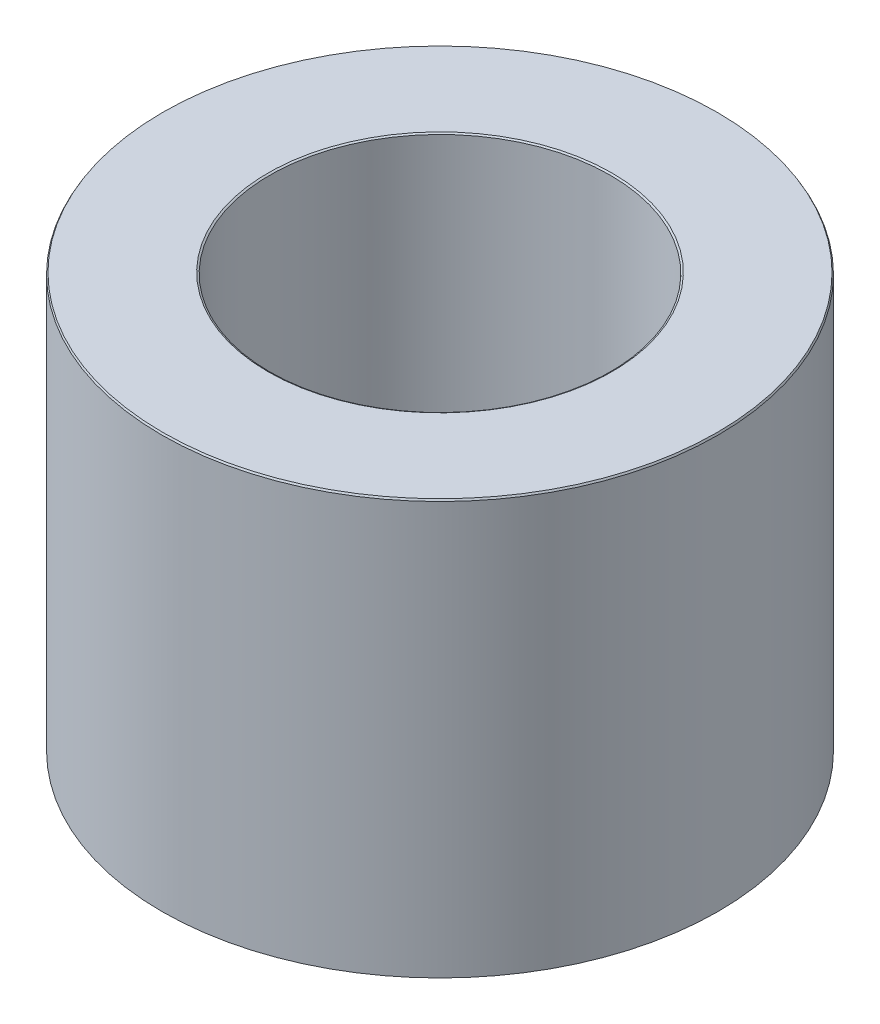
ISO-10303-21;
HEADER;
FILE_DESCRIPTION(('STEP AP214'),'2;1');
FILE_NAME('part.step','',(''),(''),'','','');
FILE_SCHEMA(('AUTOMOTIVE_DESIGN { 1 0 10303 214 1 1 1 1 }'));
ENDSEC;
DATA;
#1=APPLICATION_CONTEXT('core data for automotive mechanical design processes');
#2=APPLICATION_PROTOCOL_DEFINITION('international standard','automotive_design',2000,#1);
#3=PRODUCT_CONTEXT('',#1,'mechanical');
#4=PRODUCT('Part','Part','',(#3));
#5=PRODUCT_RELATED_PRODUCT_CATEGORY('part','',(#4));
#6=PRODUCT_DEFINITION_FORMATION('','',#4);
#7=PRODUCT_DEFINITION_CONTEXT('part definition',#1,'design');
#8=PRODUCT_DEFINITION('design','',#6,#7);
#9=PRODUCT_DEFINITION_SHAPE('','',#8);
#10=(LENGTH_UNIT() NAMED_UNIT(*) SI_UNIT(.MILLI.,.METRE.));
#11=(NAMED_UNIT(*) PLANE_ANGLE_UNIT() SI_UNIT($,.RADIAN.));
#12=(NAMED_UNIT(*) SI_UNIT($,.STERADIAN.) SOLID_ANGLE_UNIT());
#13=UNCERTAINTY_MEASURE_WITH_UNIT(LENGTH_MEASURE(1.E-05),#10,'distance_accuracy_value','');
#14=(GEOMETRIC_REPRESENTATION_CONTEXT(3) GLOBAL_UNCERTAINTY_ASSIGNED_CONTEXT((#13)) GLOBAL_UNIT_ASSIGNED_CONTEXT((#10,
#11,#12)) REPRESENTATION_CONTEXT('',''));
#15=CARTESIAN_POINT('',(0.,0.,0.));
#16=DIRECTION('',(0.,0.,1.));
#17=DIRECTION('',(1.,0.,0.));
#18=AXIS2_PLACEMENT_3D('',#15,#16,#17);
#19=CARTESIAN_POINT('',(0.,48.5175352233138,0.));
#20=DIRECTION('',(0.,-1.,0.));
#21=DIRECTION('',(0.,0.,-1.));
#22=AXIS2_PLACEMENT_3D('',#19,#20,#21);
#23=CYLINDRICAL_SURFACE('',#22,32.5);
#24=CARTESIAN_POINT('',(0.,0.117319997241808,0.));
#25=DIRECTION('',(0.,1.,0.));
#26=DIRECTION('',(0.,0.,1.));
#27=AXIS2_PLACEMENT_3D('',#24,#25,#26);
#28=CIRCLE('',#27,32.5);
#29=CARTESIAN_POINT('',(0.,0.117319997241808,32.5));
#30=VERTEX_POINT('',#29);
#31=EDGE_CURVE('E10',#30,#30,#28,.T.);
#32=ORIENTED_EDGE('',*,*,#31,.T.);
#33=EDGE_LOOP('',(#32));
#34=FACE_BOUND('',#33,.T.);
#35=CARTESIAN_POINT('',(0.,48.3143310273471,0.));
#36=DIRECTION('',(0.,1.,0.));
#37=DIRECTION('',(0.,0.,1.));
#38=AXIS2_PLACEMENT_3D('',#35,#36,#37);
#39=CIRCLE('',#38,32.5);
#40=CARTESIAN_POINT('',(0.,48.3143310273471,32.5));
#41=VERTEX_POINT('',#40);
#42=EDGE_CURVE('E50',#41,#41,#39,.F.);
#43=ORIENTED_EDGE('',*,*,#42,.T.);
#44=EDGE_LOOP('',(#43));
#45=FACE_BOUND('',#44,.T.);
#46=ADVANCED_FACE('F39',(#34,#45),#23,.T.);
#47=CARTESIAN_POINT('',(0.,48.5175352233138,0.));
#48=DIRECTION('',(0.,1.,0.));
#49=DIRECTION('',(0.,0.,1.));
#50=AXIS2_PLACEMENT_3D('',#47,#48,#49);
#51=PLANE('',#50);
#52=CARTESIAN_POINT('',(0.,48.5175352233138,0.));
#53=DIRECTION('',(0.,1.,0.));
#54=DIRECTION('',(0.,0.,1.));
#55=AXIS2_PLACEMENT_3D('',#52,#53,#54);
#56=CIRCLE('',#55,20.0981234863066);
#57=CARTESIAN_POINT('',(0.,48.5175352233138,20.0981234863066));
#58=VERTEX_POINT('',#57);
#59=EDGE_CURVE('E58',#58,#58,#56,.F.);
#60=ORIENTED_EDGE('',*,*,#59,.T.);
#61=EDGE_LOOP('',(#60));
#62=FACE_BOUND('',#61,.T.);
#63=CARTESIAN_POINT('',(0.,48.5175352233138,0.));
#64=DIRECTION('',(0.,1.,0.));
#65=DIRECTION('',(0.,0.,1.));
#66=AXIS2_PLACEMENT_3D('',#63,#64,#65);
#67=CIRCLE('',#66,32.3826800027582);
#68=CARTESIAN_POINT('',(0.,48.5175352233138,32.3826800027582));
#69=VERTEX_POINT('',#68);
#70=EDGE_CURVE('E61',#69,#69,#67,.T.);
#71=ORIENTED_EDGE('',*,*,#70,.T.);
#72=EDGE_LOOP('',(#71));
#73=FACE_BOUND('',#72,.T.);
#74=ADVANCED_FACE('F88',(#62,#73),#51,.T.);
#75=CARTESIAN_POINT('',(0.,0.,0.));
#76=DIRECTION('',(0.,1.,0.));
#77=DIRECTION('',(0.,0.,1.));
#78=AXIS2_PLACEMENT_3D('',#75,#76,#77);
#79=PLANE('',#78);
#80=CARTESIAN_POINT('',(0.,0.,0.));
#81=DIRECTION('',(0.,1.,0.));
#82=DIRECTION('',(0.,0.,1.));
#83=AXIS2_PLACEMENT_3D('',#80,#81,#82);
#84=CIRCLE('',#83,20.0122392875817);
#85=CARTESIAN_POINT('',(0.,0.,-20.0122392875817));
#86=VERTEX_POINT('',#85);
#87=EDGE_CURVE('E51',#86,#86,#84,.T.);
#88=ORIENTED_EDGE('',*,*,#87,.T.);
#89=EDGE_LOOP('',(#88));
#90=FACE_BOUND('',#89,.T.);
#91=CARTESIAN_POINT('',(0.,0.,0.));
#92=DIRECTION('',(0.,1.,0.));
#93=DIRECTION('',(0.,0.,1.));
#94=AXIS2_PLACEMENT_3D('',#91,#92,#93);
#95=CIRCLE('',#94,32.2967958040334);
#96=CARTESIAN_POINT('',(0.,0.,32.2967958040334));
#97=VERTEX_POINT('',#96);
#98=EDGE_CURVE('E54',#97,#97,#95,.F.);
#99=ORIENTED_EDGE('',*,*,#98,.T.);
#100=EDGE_LOOP('',(#99));
#101=FACE_BOUND('',#100,.T.);
#102=ADVANCED_FACE('F83',(#90,#101),#79,.F.);
#103=CARTESIAN_POINT('',(0.,48.5175352233138,0.));
#104=DIRECTION('',(0.,-1.,0.));
#105=DIRECTION('',(0.,0.,-1.));
#106=AXIS2_PLACEMENT_3D('',#103,#104,#105);
#107=CYLINDRICAL_SURFACE('',#106,19.8949192903399);
#108=CARTESIAN_POINT('',(0.,48.4002152260719,0.));
#109=DIRECTION('',(0.,1.,0.));
#110=DIRECTION('',(0.,0.,1.));
#111=AXIS2_PLACEMENT_3D('',#108,#109,#110);
#112=CIRCLE('',#111,19.8949192903399);
#113=CARTESIAN_POINT('',(0.,48.4002152260719,19.8949192903399));
#114=VERTEX_POINT('',#113);
#115=EDGE_CURVE('E67',#114,#114,#112,.T.);
#116=ORIENTED_EDGE('',*,*,#115,.T.);
#117=EDGE_LOOP('',(#116));
#118=FACE_BOUND('',#117,.T.);
#119=CARTESIAN_POINT('',(0.,0.203204195966672,0.));
#120=DIRECTION('',(0.,1.,0.));
#121=DIRECTION('',(0.,0.,1.));
#122=AXIS2_PLACEMENT_3D('',#119,#120,#121);
#123=CIRCLE('',#122,19.8949192903399);
#124=CARTESIAN_POINT('',(0.,0.203204195966672,-19.8949192903399));
#125=VERTEX_POINT('',#124);
#126=EDGE_CURVE('E69',#125,#125,#123,.F.);
#127=ORIENTED_EDGE('',*,*,#126,.T.);
#128=EDGE_LOOP('',(#127));
#129=FACE_BOUND('',#128,.T.);
#130=ADVANCED_FACE('F71',(#118,#129),#107,.F.);
#131=CARTESIAN_POINT('',(0.,48.4002152260719,0.));
#132=DIRECTION('',(0.,1.,0.));
#133=DIRECTION('',(0.,0.,1.));
#134=AXIS2_PLACEMENT_3D('',#131,#132,#133);
#135=CONICAL_SURFACE('',#134,19.8949192903399,1.04719755119662);
#136=ORIENTED_EDGE('',*,*,#59,.F.);
#137=EDGE_LOOP('',(#136));
#138=FACE_BOUND('',#137,.T.);
#139=ORIENTED_EDGE('',*,*,#115,.F.);
#140=EDGE_LOOP('',(#139));
#141=FACE_BOUND('',#140,.T.);
#142=ADVANCED_FACE('F77',(#138,#141),#135,.F.);
#143=CARTESIAN_POINT('',(0.,0.,0.));
#144=DIRECTION('',(0.,-1.,0.));
#145=DIRECTION('',(0.,0.,-1.));
#146=AXIS2_PLACEMENT_3D('',#143,#144,#145);
#147=CONICAL_SURFACE('',#146,20.0122392875817,0.523598775598319);
#148=CARTESIAN_POINT('',(0.,0.203204195966672,-19.8949192903399));
#149=CARTESIAN_POINT('',(0.,0.201087485592019,-19.8961413736445));
#150=CARTESIAN_POINT('',(0.,0.198970775217366,-19.8973634569491));
#151=CARTESIAN_POINT('',(0.,0.194737354468061,-19.8998076235583));
#152=CARTESIAN_POINT('',(0.,0.192620644093408,-19.9010297068629));
#153=CARTESIAN_POINT('',(0.,0.188387223344102,-19.9034738734721));
#154=CARTESIAN_POINT('',(0.,0.186270512969449,-19.9046959567767));
#155=CARTESIAN_POINT('',(0.,0.182037092220143,-19.9071401233859));
#156=CARTESIAN_POINT('',(0.,0.179920381845491,-19.9083622066906));
#157=CARTESIAN_POINT('',(0.,0.175686961096185,-19.9108063732998));
#158=CARTESIAN_POINT('',(0.,0.173570250721532,-19.9120284566044));
#159=CARTESIAN_POINT('',(0.,0.169336829972227,-19.9144726232136));
#160=CARTESIAN_POINT('',(0.,0.167220119597574,-19.9156947065182));
#161=CARTESIAN_POINT('',(0.,0.162986698848268,-19.9181388731274));
#162=CARTESIAN_POINT('',(0.,0.160869988473615,-19.919360956432));
#163=CARTESIAN_POINT('',(0.,0.156636567724309,-19.9218051230412));
#164=CARTESIAN_POINT('',(0.,0.154519857349657,-19.9230272063458));
#165=CARTESIAN_POINT('',(0.,0.150286436600351,-19.925471372955));
#166=CARTESIAN_POINT('',(0.,0.148169726225698,-19.9266934562596));
#167=CARTESIAN_POINT('',(0.,0.143936305476393,-19.9291376228688));
#168=CARTESIAN_POINT('',(0.,0.14181959510174,-19.9303597061734));
#169=CARTESIAN_POINT('',(0.,0.137586174352434,-19.9328038727826));
#170=CARTESIAN_POINT('',(0.,0.135469463977782,-19.9340259560872));
#171=CARTESIAN_POINT('',(0.,0.131236043228476,-19.9364701226964));
#172=CARTESIAN_POINT('',(0.,0.129119332853823,-19.937692206001));
#173=CARTESIAN_POINT('',(0.,0.124885912104517,-19.9401363726102));
#174=CARTESIAN_POINT('',(0.,0.122769201729864,-19.9413584559148));
#175=CARTESIAN_POINT('',(0.,0.118535780980559,-19.943802622524));
#176=CARTESIAN_POINT('',(0.,0.116419070605906,-19.9450247058286));
#177=CARTESIAN_POINT('',(0.,0.1121856498566,-19.9474688724378));
#178=CARTESIAN_POINT('',(0.,0.110068939481948,-19.9486909557424));
#179=CARTESIAN_POINT('',(0.,0.105835518732642,-19.9511351223516));
#180=CARTESIAN_POINT('',(0.,0.103718808357989,-19.9523572056562));
#181=CARTESIAN_POINT('',(0.,0.0994853876086828,-19.9548013722654));
#182=CARTESIAN_POINT('',(0.,0.0973686772340302,-19.95602345557));
#183=CARTESIAN_POINT('',(0.,0.0931352564847247,-19.9584676221792));
#184=CARTESIAN_POINT('',(0.,0.0910185461100718,-19.9596897054839));
#185=CARTESIAN_POINT('',(0.,0.0867851253607661,-19.9621338720931));
#186=CARTESIAN_POINT('',(0.,0.0846684149861132,-19.9633559553977));
#187=CARTESIAN_POINT('',(0.,0.0804349942368077,-19.9658001220069));
#188=CARTESIAN_POINT('',(0.,0.0783182838621551,-19.9670222053115));
#189=CARTESIAN_POINT('',(0.,0.0740848631128493,-19.9694663719207));
#190=CARTESIAN_POINT('',(0.,0.0719681527381961,-19.9706884552253));
#191=CARTESIAN_POINT('',(0.,0.0677347319888903,-19.9731326218345));
#192=CARTESIAN_POINT('',(0.,0.0656180216142377,-19.9743547051391));
#193=CARTESIAN_POINT('',(0.,0.0613846008649322,-19.9767988717483));
#194=CARTESIAN_POINT('',(0.,0.0592678904902794,-19.9780209550529));
#195=CARTESIAN_POINT('',(0.,0.0550344697409736,-19.9804651216621));
#196=CARTESIAN_POINT('',(0.,0.0529177593663207,-19.9816872049667));
#197=CARTESIAN_POINT('',(0.,0.0486843386170152,-19.9841313715759));
#198=CARTESIAN_POINT('',(0.,0.0465676282423626,-19.9853534548805));
#199=CARTESIAN_POINT('',(0.,0.0423342074930568,-19.9877976214897));
#200=CARTESIAN_POINT('',(0.,0.0402174971184036,-19.9890197047943));
#201=CARTESIAN_POINT('',(0.,0.0359840763690978,-19.9914638714035));
#202=CARTESIAN_POINT('',(0.,0.0338673659944453,-19.9926859547081));
#203=CARTESIAN_POINT('',(0.,0.0296339452451397,-19.9951301213173));
#204=CARTESIAN_POINT('',(0.,0.0275172348704868,-19.9963522046219));
#205=CARTESIAN_POINT('',(0.,0.0232838141211812,-19.9987963712311));
#206=CARTESIAN_POINT('',(0.,0.0211671037465286,-20.0000184545357));
#207=CARTESIAN_POINT('',(0.,0.0169336829972229,-20.0024626211449));
#208=CARTESIAN_POINT('',(0.,0.0148169726225697,-20.0036847044495));
#209=CARTESIAN_POINT('',(0.,0.0105835518732638,-20.0061288710587));
#210=CARTESIAN_POINT('',(0.,0.00846684149861116,-20.0073509543633));
#211=CARTESIAN_POINT('',(0.,0.00423342074930584,-20.0097951209725));
#212=CARTESIAN_POINT('',(0.,0.00211671037465318,-20.0110172042771));
#213=CARTESIAN_POINT('',(0.,0.,-20.0122392875817));
#214=B_SPLINE_CURVE_WITH_KNOTS('',3,(#148,#149,#150,#151,#152,#153,#154,#155,#156,#157,#158,
#159,#160,#161,#162,#163,#164,#165,#166,#167,#168,#169,#170,#171,#172,#173,#174,#175,#176,#177,
#178,#179,#180,#181,#182,#183,#184,#185,#186,#187,#188,#189,#190,#191,#192,#193,#194,#195,#196,
#197,#198,#199,#200,#201,#202,#203,#204,#205,#206,#207,#208,#209,#210,#211,#212,#213),
.UNSPECIFIED.,.F.,.F.,(4,2,2,2,2,2,2,2,2,2,2,2,2,2,2,2,2,2,2,2,2,2,2,2,2,2,2,2,2,2,2,2,4),(0.,
0.00733249982761418,0.0146649996552284,0.0219974994828408,0.029329999310455,0.0366624991380692,
0.0439949989656834,0.0513274987932958,0.05865999862091,0.0659924984485242,0.0733249982761384,
0.0806574981037526,0.087989997931365,0.0953224977589792,0.102654997586593,0.109987497414208,
0.11731999724182,0.124652497069434,0.131984996897048,0.139317496724663,0.146649996552277,
0.153982496379889,0.161314996207503,0.168647496035118,0.175979995862732,0.183312495690346,
0.190644995517958,0.197977495345573,0.205309995173187,0.212642495000801,0.219974994828413,
0.227307494656028,0.234639994483642),.UNSPECIFIED.);
#215=EDGE_CURVE('BSEAM73',#125,#86,#214,.T.);
#216=ORIENTED_EDGE('',*,*,#126,.F.);
#217=ORIENTED_EDGE('',*,*,#87,.F.);
#218=ORIENTED_EDGE('',*,*,#215,.T.);
#219=ORIENTED_EDGE('',*,*,#215,.F.);
#220=EDGE_LOOP('',(#216,#218,#217,#219));
#221=FACE_BOUND('',#220,.T.);
#222=ADVANCED_FACE('F73',(#221),#147,.F.);
#223=CARTESIAN_POINT('',(0.,0.117319997241808,0.));
#224=DIRECTION('',(0.,1.,0.));
#225=DIRECTION('',(0.,0.,1.));
#226=AXIS2_PLACEMENT_3D('',#223,#224,#225);
#227=CONICAL_SURFACE('',#226,32.5,1.0471975511966);
#228=ORIENTED_EDGE('',*,*,#98,.F.);
#229=EDGE_LOOP('',(#228));
#230=FACE_BOUND('',#229,.T.);
#231=ORIENTED_EDGE('',*,*,#31,.F.);
#232=EDGE_LOOP('',(#231));
#233=FACE_BOUND('',#232,.T.);
#234=ADVANCED_FACE('F76',(#230,#233),#227,.T.);
#235=CARTESIAN_POINT('',(0.,48.5175352233138,0.));
#236=DIRECTION('',(0.,-1.,0.));
#237=DIRECTION('',(0.,0.,-1.));
#238=AXIS2_PLACEMENT_3D('',#235,#236,#237);
#239=CONICAL_SURFACE('',#238,32.3826800027582,0.523598775598287);
#240=ORIENTED_EDGE('',*,*,#42,.F.);
#241=EDGE_LOOP('',(#240));
#242=FACE_BOUND('',#241,.T.);
#243=ORIENTED_EDGE('',*,*,#70,.F.);
#244=EDGE_LOOP('',(#243));
#245=FACE_BOUND('',#244,.T.);
#246=ADVANCED_FACE('F45',(#242,#245),#239,.T.);
#247=CLOSED_SHELL('',(#46,#74,#102,#130,#142,#222,#234,#246));
#248=MANIFOLD_SOLID_BREP('B2',#247);
#249=ADVANCED_BREP_SHAPE_REPRESENTATION('',(#18,#248),#14);
#250=SHAPE_DEFINITION_REPRESENTATION(#9,#249);
ENDSEC;
END-ISO-10303-21;
